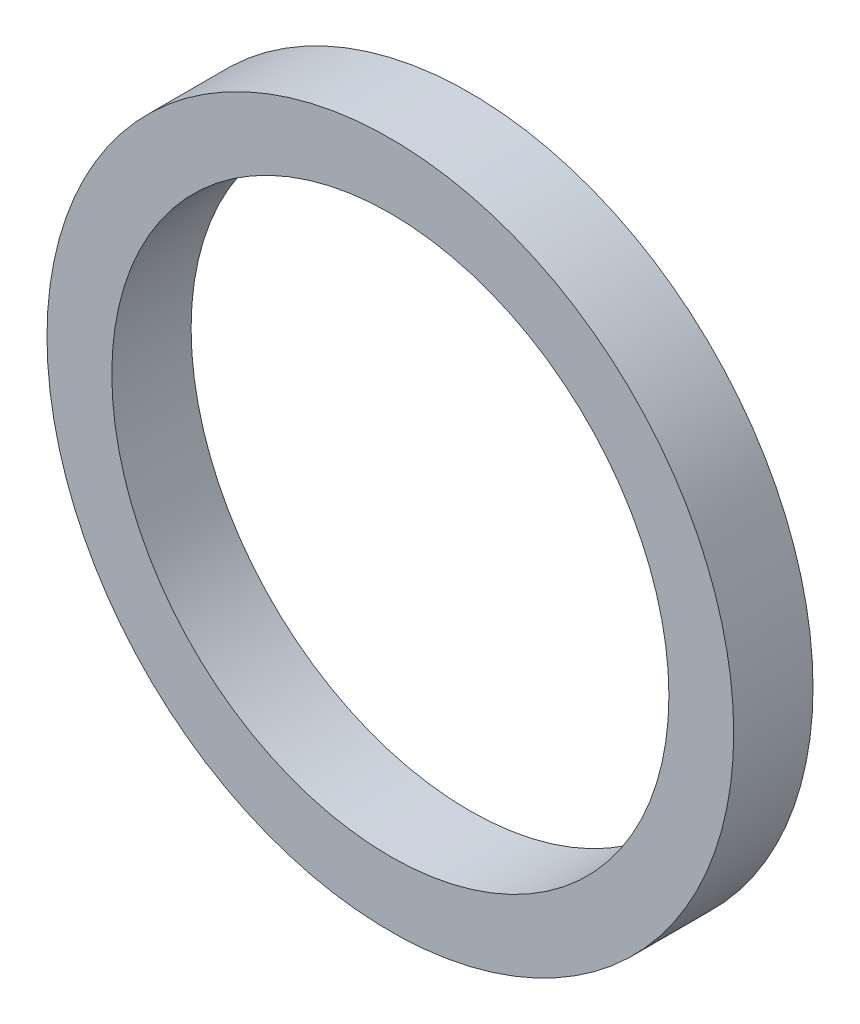
ISO-10303-21;
HEADER;
FILE_DESCRIPTION(('STEP AP214'),'2;1');
FILE_NAME('part.step','',(''),(''),'','','');
FILE_SCHEMA(('AUTOMOTIVE_DESIGN { 1 0 10303 214 1 1 1 1 }'));
ENDSEC;
DATA;
#1=APPLICATION_CONTEXT('core data for automotive mechanical design processes');
#2=APPLICATION_PROTOCOL_DEFINITION('international standard','automotive_design',2000,#1);
#3=PRODUCT_CONTEXT('',#1,'mechanical');
#4=PRODUCT('Part','Part','',(#3));
#5=PRODUCT_RELATED_PRODUCT_CATEGORY('part','',(#4));
#6=PRODUCT_DEFINITION_FORMATION('','',#4);
#7=PRODUCT_DEFINITION_CONTEXT('part definition',#1,'design');
#8=PRODUCT_DEFINITION('design','',#6,#7);
#9=PRODUCT_DEFINITION_SHAPE('','',#8);
#10=(LENGTH_UNIT() NAMED_UNIT(*) SI_UNIT(.MILLI.,.METRE.));
#11=(NAMED_UNIT(*) PLANE_ANGLE_UNIT() SI_UNIT($,.RADIAN.));
#12=(NAMED_UNIT(*) SI_UNIT($,.STERADIAN.) SOLID_ANGLE_UNIT());
#13=UNCERTAINTY_MEASURE_WITH_UNIT(LENGTH_MEASURE(1.E-05),#10,'distance_accuracy_value','');
#14=(GEOMETRIC_REPRESENTATION_CONTEXT(3) GLOBAL_UNCERTAINTY_ASSIGNED_CONTEXT((#13)) GLOBAL_UNIT_ASSIGNED_CONTEXT((#10,
#11,#12)) REPRESENTATION_CONTEXT('',''));
#15=CARTESIAN_POINT('',(0.,0.,0.));
#16=DIRECTION('',(0.,0.,1.));
#17=DIRECTION('',(1.,0.,0.));
#18=AXIS2_PLACEMENT_3D('',#15,#16,#17);
#19=CARTESIAN_POINT('',(0.,0.,7.61999999999987));
#20=DIRECTION('',(0.,0.,-1.));
#21=DIRECTION('',(-1.,0.,0.));
#22=AXIS2_PLACEMENT_3D('',#19,#20,#21);
#23=CYLINDRICAL_SURFACE('',#22,32.9998889124988);
#24=CARTESIAN_POINT('',(0.,0.,7.61999999999987));
#25=DIRECTION('',(0.,0.,1.));
#26=DIRECTION('',(1.,0.,0.));
#27=AXIS2_PLACEMENT_3D('',#24,#25,#26);
#28=CIRCLE('',#27,32.9998889124988);
#29=CARTESIAN_POINT('',(32.9998889124988,0.,7.61999999999987));
#30=VERTEX_POINT('',#29);
#31=EDGE_CURVE('E10',#30,#30,#28,.T.);
#32=ORIENTED_EDGE('',*,*,#31,.F.);
#33=EDGE_LOOP('',(#32));
#34=FACE_BOUND('',#33,.T.);
#35=CARTESIAN_POINT('',(0.,0.,0.));
#36=DIRECTION('',(0.,0.,1.));
#37=DIRECTION('',(1.,0.,0.));
#38=AXIS2_PLACEMENT_3D('',#35,#36,#37);
#39=CIRCLE('',#38,32.9998889124988);
#40=CARTESIAN_POINT('',(32.9998889124988,0.,0.));
#41=VERTEX_POINT('',#40);
#42=EDGE_CURVE('E36',#41,#41,#39,.T.);
#43=ORIENTED_EDGE('',*,*,#42,.T.);
#44=EDGE_LOOP('',(#43));
#45=FACE_BOUND('',#44,.T.);
#46=ADVANCED_FACE('F33',(#34,#45),#23,.T.);
#47=CARTESIAN_POINT('',(0.,0.,7.61999999999987));
#48=DIRECTION('',(0.,0.,1.));
#49=DIRECTION('',(1.,0.,0.));
#50=AXIS2_PLACEMENT_3D('',#47,#48,#49);
#51=PLANE('',#50);
#52=CARTESIAN_POINT('',(0.,0.,7.61999999999987));
#53=DIRECTION('',(0.,0.,1.));
#54=DIRECTION('',(1.,0.,0.));
#55=AXIS2_PLACEMENT_3D('',#52,#53,#54);
#56=CIRCLE('',#55,26.7701424075053);
#57=CARTESIAN_POINT('',(26.7701424075053,0.,7.61999999999987));
#58=VERTEX_POINT('',#57);
#59=EDGE_CURVE('E45',#58,#58,#56,.T.);
#60=ORIENTED_EDGE('',*,*,#59,.F.);
#61=EDGE_LOOP('',(#60));
#62=FACE_BOUND('',#61,.T.);
#63=ORIENTED_EDGE('',*,*,#31,.T.);
#64=EDGE_LOOP('',(#63));
#65=FACE_BOUND('',#64,.T.);
#66=ADVANCED_FACE('F60',(#62,#65),#51,.T.);
#67=CARTESIAN_POINT('',(0.,0.,0.));
#68=DIRECTION('',(0.,0.,1.));
#69=DIRECTION('',(1.,0.,0.));
#70=AXIS2_PLACEMENT_3D('',#67,#68,#69);
#71=PLANE('',#70);
#72=CARTESIAN_POINT('',(0.,0.,0.));
#73=DIRECTION('',(0.,0.,1.));
#74=DIRECTION('',(1.,0.,0.));
#75=AXIS2_PLACEMENT_3D('',#72,#73,#74);
#76=CIRCLE('',#75,26.7701424075053);
#77=CARTESIAN_POINT('',(26.7701424075053,0.,0.));
#78=VERTEX_POINT('',#77);
#79=EDGE_CURVE('E43',#78,#78,#76,.T.);
#80=ORIENTED_EDGE('',*,*,#79,.T.);
#81=EDGE_LOOP('',(#80));
#82=FACE_BOUND('',#81,.T.);
#83=ORIENTED_EDGE('',*,*,#42,.F.);
#84=EDGE_LOOP('',(#83));
#85=FACE_BOUND('',#84,.T.);
#86=ADVANCED_FACE('F51',(#82,#85),#71,.F.);
#87=CARTESIAN_POINT('',(0.,0.,0.));
#88=DIRECTION('',(0.,0.,1.));
#89=DIRECTION('',(1.,0.,0.));
#90=AXIS2_PLACEMENT_3D('',#87,#88,#89);
#91=CYLINDRICAL_SURFACE('',#90,26.7701424075053);
#92=ORIENTED_EDGE('',*,*,#79,.F.);
#93=EDGE_LOOP('',(#92));
#94=FACE_BOUND('',#93,.T.);
#95=ORIENTED_EDGE('',*,*,#59,.T.);
#96=EDGE_LOOP('',(#95));
#97=FACE_BOUND('',#96,.T.);
#98=ADVANCED_FACE('F54',(#94,#97),#91,.F.);
#99=CLOSED_SHELL('',(#46,#66,#86,#98));
#100=MANIFOLD_SOLID_BREP('B2',#99);
#101=ADVANCED_BREP_SHAPE_REPRESENTATION('',(#18,#100),#14);
#102=SHAPE_DEFINITION_REPRESENTATION(#9,#101);
ENDSEC;
END-ISO-10303-21;
